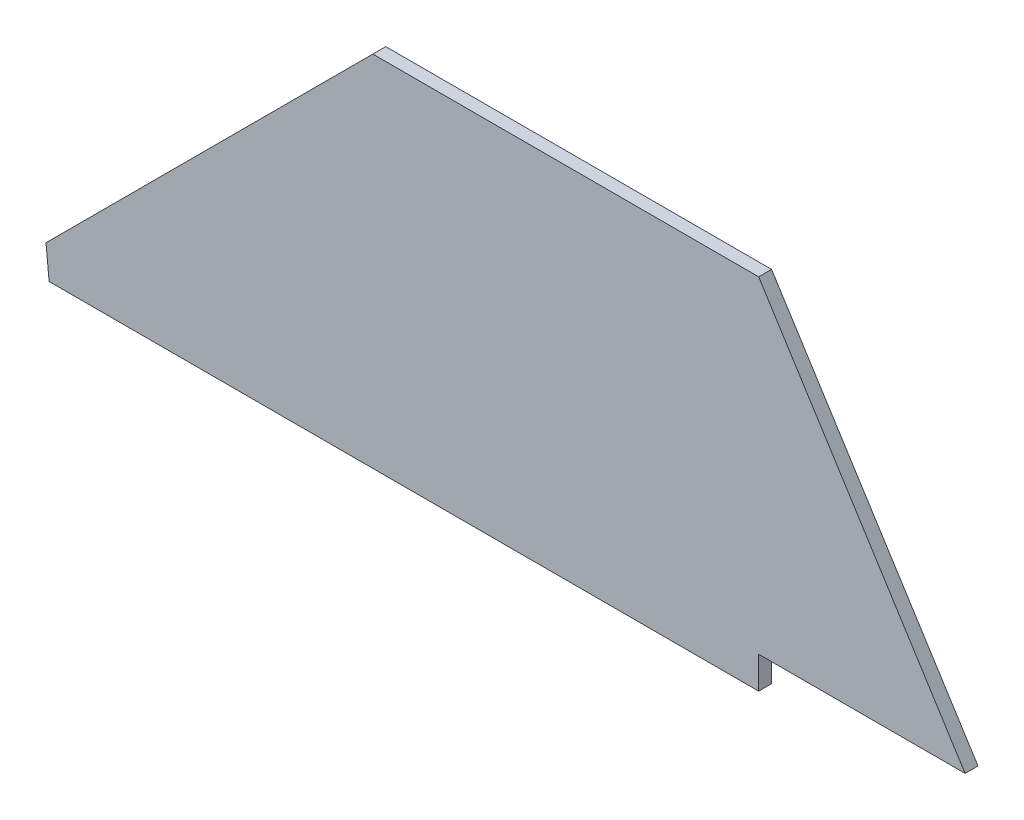
ISO-10303-21;
HEADER;
FILE_DESCRIPTION(('STEP AP214'),'2;1');
FILE_NAME('part.step','',(''),(''),'','','');
FILE_SCHEMA(('AUTOMOTIVE_DESIGN { 1 0 10303 214 1 1 1 1 }'));
ENDSEC;
DATA;
#1=APPLICATION_CONTEXT('core data for automotive mechanical design processes');
#2=APPLICATION_PROTOCOL_DEFINITION('international standard','automotive_design',2000,#1);
#3=PRODUCT_CONTEXT('',#1,'mechanical');
#4=PRODUCT('Part','Part','',(#3));
#5=PRODUCT_RELATED_PRODUCT_CATEGORY('part','',(#4));
#6=PRODUCT_DEFINITION_FORMATION('','',#4);
#7=PRODUCT_DEFINITION_CONTEXT('part definition',#1,'design');
#8=PRODUCT_DEFINITION('design','',#6,#7);
#9=PRODUCT_DEFINITION_SHAPE('','',#8);
#10=(LENGTH_UNIT() NAMED_UNIT(*) SI_UNIT(.MILLI.,.METRE.));
#11=(NAMED_UNIT(*) PLANE_ANGLE_UNIT() SI_UNIT($,.RADIAN.));
#12=(NAMED_UNIT(*) SI_UNIT($,.STERADIAN.) SOLID_ANGLE_UNIT());
#13=UNCERTAINTY_MEASURE_WITH_UNIT(LENGTH_MEASURE(1.E-05),#10,'distance_accuracy_value','');
#14=(GEOMETRIC_REPRESENTATION_CONTEXT(3) GLOBAL_UNCERTAINTY_ASSIGNED_CONTEXT((#13)) GLOBAL_UNIT_ASSIGNED_CONTEXT((#10,
#11,#12)) REPRESENTATION_CONTEXT('',''));
#15=CARTESIAN_POINT('',(0.,0.,0.));
#16=DIRECTION('',(0.,0.,1.));
#17=DIRECTION('',(1.,0.,0.));
#18=AXIS2_PLACEMENT_3D('',#15,#16,#17);
#19=CARTESIAN_POINT('',(-0.760307597324186,7.874,3.175));
#20=DIRECTION('',(0.995370502811427,0.0961122371653445,0.));
#21=DIRECTION('',(-0.0961122371653445,0.995370502811427,0.));
#22=AXIS2_PLACEMENT_3D('',#19,#20,#21);
#23=PLANE('',#22);
#24=DIRECTION('',(0.0961122371653445,-0.995370502811427,0.));
#25=VECTOR('',#24,1.);
#26=CARTESIAN_POINT('',(-0.760307597324186,7.874,0.));
#27=LINE('',#26,#25);
#28=CARTESIAN_POINT('',(-0.760307597324186,7.874,0.));
#29=VERTEX_POINT('',#28);
#30=CARTESIAN_POINT('',(0.,0.,0.));
#31=VERTEX_POINT('',#30);
#32=EDGE_CURVE('E123',#29,#31,#27,.T.);
#33=ORIENTED_EDGE('',*,*,#32,.T.);
#34=DIRECTION('',(0.,0.,-1.));
#35=VECTOR('',#34,1.);
#36=CARTESIAN_POINT('',(0.,0.,3.175));
#37=LINE('',#36,#35);
#38=CARTESIAN_POINT('',(0.,0.,3.175));
#39=VERTEX_POINT('',#38);
#40=EDGE_CURVE('E11',#39,#31,#37,.T.);
#41=ORIENTED_EDGE('',*,*,#40,.F.);
#42=DIRECTION('',(0.0961122371653445,-0.995370502811427,0.));
#43=VECTOR('',#42,1.);
#44=CARTESIAN_POINT('',(-0.760307597324186,7.874,3.175));
#45=LINE('',#44,#43);
#46=CARTESIAN_POINT('',(-0.760307597324186,7.874,3.175));
#47=VERTEX_POINT('',#46);
#48=EDGE_CURVE('E135',#47,#39,#45,.T.);
#49=ORIENTED_EDGE('',*,*,#48,.F.);
#50=DIRECTION('',(0.,0.,-1.));
#51=VECTOR('',#50,1.);
#52=CARTESIAN_POINT('',(-0.760307597324186,7.874,3.175));
#53=LINE('',#52,#51);
#54=EDGE_CURVE('E119',#47,#29,#53,.T.);
#55=ORIENTED_EDGE('',*,*,#54,.T.);
#56=EDGE_LOOP('',(#33,#41,#49,#55));
#57=FACE_BOUND('',#56,.T.);
#58=ADVANCED_FACE('F33',(#57),#23,.F.);
#59=CARTESIAN_POINT('',(0.,0.,3.175));
#60=DIRECTION('',(0.,1.,0.));
#61=DIRECTION('',(0.,0.,1.));
#62=AXIS2_PLACEMENT_3D('',#59,#60,#61);
#63=PLANE('',#62);
#64=DIRECTION('',(1.,0.,0.));
#65=VECTOR('',#64,1.);
#66=CARTESIAN_POINT('',(0.,0.,0.));
#67=LINE('',#66,#65);
#68=CARTESIAN_POINT('',(174.625,0.,0.));
#69=VERTEX_POINT('',#68);
#70=EDGE_CURVE('E126',#31,#69,#67,.T.);
#71=ORIENTED_EDGE('',*,*,#70,.T.);
#72=DIRECTION('',(0.,0.,-1.));
#73=VECTOR('',#72,1.);
#74=CARTESIAN_POINT('',(174.625,0.,3.175));
#75=LINE('',#74,#73);
#76=CARTESIAN_POINT('',(174.625,0.,3.175));
#77=VERTEX_POINT('',#76);
#78=EDGE_CURVE('E41',#77,#69,#75,.T.);
#79=ORIENTED_EDGE('',*,*,#78,.F.);
#80=DIRECTION('',(1.,0.,0.));
#81=VECTOR('',#80,1.);
#82=CARTESIAN_POINT('',(0.,0.,3.175));
#83=LINE('',#82,#81);
#84=EDGE_CURVE('E89',#39,#77,#83,.T.);
#85=ORIENTED_EDGE('',*,*,#84,.F.);
#86=ORIENTED_EDGE('',*,*,#40,.T.);
#87=EDGE_LOOP('',(#71,#79,#85,#86));
#88=FACE_BOUND('',#87,.T.);
#89=ADVANCED_FACE('F160',(#88),#63,.F.);
#90=CARTESIAN_POINT('',(174.625,0.,3.175));
#91=DIRECTION('',(-1.,0.,0.));
#92=DIRECTION('',(0.,0.,1.));
#93=AXIS2_PLACEMENT_3D('',#90,#91,#92);
#94=PLANE('',#93);
#95=DIRECTION('',(0.,1.,0.));
#96=VECTOR('',#95,1.);
#97=CARTESIAN_POINT('',(174.625,0.,0.));
#98=LINE('',#97,#96);
#99=CARTESIAN_POINT('',(174.625,7.874,0.));
#100=VERTEX_POINT('',#99);
#101=EDGE_CURVE('E128',#69,#100,#98,.T.);
#102=ORIENTED_EDGE('',*,*,#101,.T.);
#103=DIRECTION('',(0.,0.,-1.));
#104=VECTOR('',#103,1.);
#105=CARTESIAN_POINT('',(174.625,7.874,3.175));
#106=LINE('',#105,#104);
#107=CARTESIAN_POINT('',(174.625,7.874,3.175));
#108=VERTEX_POINT('',#107);
#109=EDGE_CURVE('E139',#108,#100,#106,.T.);
#110=ORIENTED_EDGE('',*,*,#109,.F.);
#111=DIRECTION('',(0.,1.,0.));
#112=VECTOR('',#111,1.);
#113=CARTESIAN_POINT('',(174.625,0.,3.175));
#114=LINE('',#113,#112);
#115=EDGE_CURVE('E147',#77,#108,#114,.T.);
#116=ORIENTED_EDGE('',*,*,#115,.F.);
#117=ORIENTED_EDGE('',*,*,#78,.T.);
#118=EDGE_LOOP('',(#102,#110,#116,#117));
#119=FACE_BOUND('',#118,.T.);
#120=ADVANCED_FACE('F145',(#119),#94,.F.);
#121=CARTESIAN_POINT('',(174.625,7.874,3.175));
#122=DIRECTION('',(0.,1.,0.));
#123=DIRECTION('',(0.,0.,1.));
#124=AXIS2_PLACEMENT_3D('',#121,#122,#123);
#125=PLANE('',#124);
#126=DIRECTION('',(1.,0.,0.));
#127=VECTOR('',#126,1.);
#128=CARTESIAN_POINT('',(174.625,7.874,0.));
#129=LINE('',#128,#127);
#130=CARTESIAN_POINT('',(225.425,7.874,0.));
#131=VERTEX_POINT('',#130);
#132=EDGE_CURVE('E130',#100,#131,#129,.T.);
#133=ORIENTED_EDGE('',*,*,#132,.T.);
#134=DIRECTION('',(0.,0.,-1.));
#135=VECTOR('',#134,1.);
#136=CARTESIAN_POINT('',(225.425,7.874,3.175));
#137=LINE('',#136,#135);
#138=CARTESIAN_POINT('',(225.425,7.874,3.175));
#139=VERTEX_POINT('',#138);
#140=EDGE_CURVE('E114',#139,#131,#137,.T.);
#141=ORIENTED_EDGE('',*,*,#140,.F.);
#142=DIRECTION('',(1.,0.,0.));
#143=VECTOR('',#142,1.);
#144=CARTESIAN_POINT('',(174.625,7.874,3.175));
#145=LINE('',#144,#143);
#146=EDGE_CURVE('E105',#108,#139,#145,.T.);
#147=ORIENTED_EDGE('',*,*,#146,.F.);
#148=ORIENTED_EDGE('',*,*,#109,.T.);
#149=EDGE_LOOP('',(#133,#141,#147,#148));
#150=FACE_BOUND('',#149,.T.);
#151=ADVANCED_FACE('F153',(#150),#125,.F.);
#152=CARTESIAN_POINT('',(225.425,7.874,3.175));
#153=DIRECTION('',(-0.845487115079304,-0.533995822300958,0.));
#154=DIRECTION('',(0.533995822300958,-0.845487115079304,0.));
#155=AXIS2_PLACEMENT_3D('',#152,#153,#154);
#156=PLANE('',#155);
#157=DIRECTION('',(-0.533995822300958,0.845487115079304,0.));
#158=VECTOR('',#157,1.);
#159=CARTESIAN_POINT('',(225.425,7.874,0.));
#160=LINE('',#159,#158);
#161=CARTESIAN_POINT('',(174.625,88.3067368348245,0.));
#162=VERTEX_POINT('',#161);
#163=EDGE_CURVE('E113',#131,#162,#160,.T.);
#164=ORIENTED_EDGE('',*,*,#163,.T.);
#165=DIRECTION('',(0.,0.,-1.));
#166=VECTOR('',#165,1.);
#167=CARTESIAN_POINT('',(174.625,88.3067368348245,3.175));
#168=LINE('',#167,#166);
#169=CARTESIAN_POINT('',(174.625,88.3067368348245,3.175));
#170=VERTEX_POINT('',#169);
#171=EDGE_CURVE('E110',#170,#162,#168,.T.);
#172=ORIENTED_EDGE('',*,*,#171,.F.);
#173=DIRECTION('',(-0.533995822300958,0.845487115079304,0.));
#174=VECTOR('',#173,1.);
#175=CARTESIAN_POINT('',(225.425,7.874,3.175));
#176=LINE('',#175,#174);
#177=EDGE_CURVE('E99',#139,#170,#176,.T.);
#178=ORIENTED_EDGE('',*,*,#177,.F.);
#179=ORIENTED_EDGE('',*,*,#140,.T.);
#180=EDGE_LOOP('',(#164,#172,#178,#179));
#181=FACE_BOUND('',#180,.T.);
#182=ADVANCED_FACE('F111',(#181),#156,.F.);
#183=CARTESIAN_POINT('',(174.625,88.3067368348245,3.175));
#184=DIRECTION('',(0.,-1.,0.));
#185=DIRECTION('',(0.,0.,-1.));
#186=AXIS2_PLACEMENT_3D('',#183,#184,#185);
#187=PLANE('',#186);
#188=DIRECTION('',(-1.,0.,0.));
#189=VECTOR('',#188,1.);
#190=CARTESIAN_POINT('',(174.625,88.3067368348245,0.));
#191=LINE('',#190,#189);
#192=CARTESIAN_POINT('',(79.6724292375,88.3067368348245,0.));
#193=VERTEX_POINT('',#192);
#194=EDGE_CURVE('E75',#162,#193,#191,.T.);
#195=ORIENTED_EDGE('',*,*,#194,.T.);
#196=DIRECTION('',(0.,0.,-1.));
#197=VECTOR('',#196,1.);
#198=CARTESIAN_POINT('',(79.6724292375,88.3067368348245,3.175));
#199=LINE('',#198,#197);
#200=CARTESIAN_POINT('',(79.6724292375,88.3067368348245,3.175));
#201=VERTEX_POINT('',#200);
#202=EDGE_CURVE('E115',#201,#193,#199,.T.);
#203=ORIENTED_EDGE('',*,*,#202,.F.);
#204=DIRECTION('',(-1.,0.,0.));
#205=VECTOR('',#204,1.);
#206=CARTESIAN_POINT('',(174.625,88.3067368348245,3.175));
#207=LINE('',#206,#205);
#208=EDGE_CURVE('E103',#170,#201,#207,.T.);
#209=ORIENTED_EDGE('',*,*,#208,.F.);
#210=ORIENTED_EDGE('',*,*,#171,.T.);
#211=EDGE_LOOP('',(#195,#203,#209,#210));
#212=FACE_BOUND('',#211,.T.);
#213=ADVANCED_FACE('F117',(#212),#187,.F.);
#214=CARTESIAN_POINT('',(79.6724292375,88.3067368348245,3.175));
#215=DIRECTION('',(0.707106781186549,-0.707106781186546,0.));
#216=DIRECTION('',(0.707106781186546,0.707106781186549,0.));
#217=AXIS2_PLACEMENT_3D('',#214,#215,#216);
#218=PLANE('',#217);
#219=DIRECTION('',(-0.707106781186546,-0.707106781186549,0.));
#220=VECTOR('',#219,1.);
#221=CARTESIAN_POINT('',(79.6724292375,88.3067368348245,0.));
#222=LINE('',#221,#220);
#223=EDGE_CURVE('E81',#193,#29,#222,.T.);
#224=ORIENTED_EDGE('',*,*,#223,.T.);
#225=ORIENTED_EDGE('',*,*,#54,.F.);
#226=DIRECTION('',(-0.707106781186546,-0.707106781186549,0.));
#227=VECTOR('',#226,1.);
#228=CARTESIAN_POINT('',(79.6724292375,88.3067368348245,3.175));
#229=LINE('',#228,#227);
#230=EDGE_CURVE('E49',#201,#47,#229,.T.);
#231=ORIENTED_EDGE('',*,*,#230,.F.);
#232=ORIENTED_EDGE('',*,*,#202,.T.);
#233=EDGE_LOOP('',(#224,#225,#231,#232));
#234=FACE_BOUND('',#233,.T.);
#235=ADVANCED_FACE('F174',(#234),#218,.F.);
#236=CARTESIAN_POINT('',(0.,0.,3.175));
#237=DIRECTION('',(0.,0.,1.));
#238=DIRECTION('',(1.,0.,0.));
#239=AXIS2_PLACEMENT_3D('',#236,#237,#238);
#240=PLANE('',#239);
#241=ORIENTED_EDGE('',*,*,#48,.T.);
#242=ORIENTED_EDGE('',*,*,#84,.T.);
#243=ORIENTED_EDGE('',*,*,#115,.T.);
#244=ORIENTED_EDGE('',*,*,#146,.T.);
#245=ORIENTED_EDGE('',*,*,#177,.T.);
#246=ORIENTED_EDGE('',*,*,#208,.T.);
#247=ORIENTED_EDGE('',*,*,#230,.T.);
#248=EDGE_LOOP('',(#241,#242,#243,#244,#245,#246,#247));
#249=FACE_BOUND('',#248,.T.);
#250=ADVANCED_FACE('F101',(#249),#240,.T.);
#251=CARTESIAN_POINT('',(0.,0.,0.));
#252=DIRECTION('',(0.,0.,1.));
#253=DIRECTION('',(1.,0.,0.));
#254=AXIS2_PLACEMENT_3D('',#251,#252,#253);
#255=PLANE('',#254);
#256=ORIENTED_EDGE('',*,*,#32,.F.);
#257=ORIENTED_EDGE('',*,*,#223,.F.);
#258=ORIENTED_EDGE('',*,*,#194,.F.);
#259=ORIENTED_EDGE('',*,*,#163,.F.);
#260=ORIENTED_EDGE('',*,*,#132,.F.);
#261=ORIENTED_EDGE('',*,*,#101,.F.);
#262=ORIENTED_EDGE('',*,*,#70,.F.);
#263=EDGE_LOOP('',(#256,#257,#258,#259,#260,#261,#262));
#264=FACE_BOUND('',#263,.T.);
#265=ADVANCED_FACE('F151',(#264),#255,.F.);
#266=CLOSED_SHELL('',(#58,#89,#120,#151,#182,#213,#235,#250,#265));
#267=MANIFOLD_SOLID_BREP('B2',#266);
#268=ADVANCED_BREP_SHAPE_REPRESENTATION('',(#18,#267),#14);
#269=SHAPE_DEFINITION_REPRESENTATION(#9,#268);
ENDSEC;
END-ISO-10303-21;
